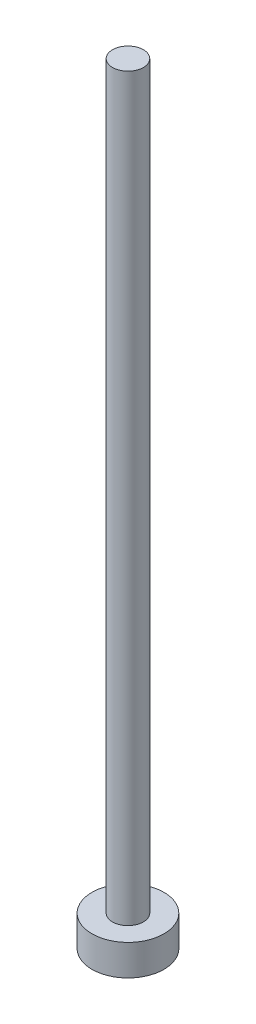
ISO-10303-21;
HEADER;
FILE_DESCRIPTION(('STEP AP214'),'2;1');
FILE_NAME('part.step','',(''),(''),'','','');
FILE_SCHEMA(('AUTOMOTIVE_DESIGN { 1 0 10303 214 1 1 1 1 }'));
ENDSEC;
DATA;
#1=APPLICATION_CONTEXT('core data for automotive mechanical design processes');
#2=APPLICATION_PROTOCOL_DEFINITION('international standard','automotive_design',2000,#1);
#3=PRODUCT_CONTEXT('',#1,'mechanical');
#4=PRODUCT('Part','Part','',(#3));
#5=PRODUCT_RELATED_PRODUCT_CATEGORY('part','',(#4));
#6=PRODUCT_DEFINITION_FORMATION('','',#4);
#7=PRODUCT_DEFINITION_CONTEXT('part definition',#1,'design');
#8=PRODUCT_DEFINITION('design','',#6,#7);
#9=PRODUCT_DEFINITION_SHAPE('','',#8);
#10=(LENGTH_UNIT() NAMED_UNIT(*) SI_UNIT(.MILLI.,.METRE.));
#11=(NAMED_UNIT(*) PLANE_ANGLE_UNIT() SI_UNIT($,.RADIAN.));
#12=(NAMED_UNIT(*) SI_UNIT($,.STERADIAN.) SOLID_ANGLE_UNIT());
#13=UNCERTAINTY_MEASURE_WITH_UNIT(LENGTH_MEASURE(1.E-05),#10,'distance_accuracy_value','');
#14=(GEOMETRIC_REPRESENTATION_CONTEXT(3) GLOBAL_UNCERTAINTY_ASSIGNED_CONTEXT((#13)) GLOBAL_UNIT_ASSIGNED_CONTEXT((#10,
#11,#12)) REPRESENTATION_CONTEXT('',''));
#15=CARTESIAN_POINT('',(0.,0.,0.));
#16=DIRECTION('',(0.,0.,1.));
#17=DIRECTION('',(1.,0.,0.));
#18=AXIS2_PLACEMENT_3D('',#15,#16,#17);
#19=CARTESIAN_POINT('',(0.869999999999995,54.6860176491151,0.));
#20=DIRECTION('',(0.,-1.,0.));
#21=DIRECTION('',(0.,0.,-1.));
#22=AXIS2_PLACEMENT_3D('',#19,#20,#21);
#23=PLANE('',#22);
#24=CARTESIAN_POINT('',(0.,54.6860176491151,0.));
#25=DIRECTION('',(0.,1.,0.));
#26=DIRECTION('',(0.,0.,1.));
#27=AXIS2_PLACEMENT_3D('',#24,#25,#26);
#28=CIRCLE('',#27,0.869999999999995);
#29=CARTESIAN_POINT('',(0.,54.6860176491151,0.869999999999995));
#30=VERTEX_POINT('',#29);
#31=EDGE_CURVE('E11',#30,#30,#28,.T.);
#32=ORIENTED_EDGE('',*,*,#31,.T.);
#33=EDGE_LOOP('',(#32));
#34=FACE_BOUND('',#33,.T.);
#35=ADVANCED_FACE('F34',(#34),#23,.F.);
#36=CARTESIAN_POINT('',(0.,58.6084508221692,0.));
#37=DIRECTION('',(0.,1.,0.));
#38=DIRECTION('',(0.,0.,1.));
#39=AXIS2_PLACEMENT_3D('',#36,#37,#38);
#40=CYLINDRICAL_SURFACE('',#39,0.87);
#41=ORIENTED_EDGE('',*,*,#31,.F.);
#42=EDGE_LOOP('',(#41));
#43=FACE_BOUND('',#42,.T.);
#44=CARTESIAN_POINT('',(0.,12.9260176491151,0.));
#45=DIRECTION('',(0.,1.,0.));
#46=DIRECTION('',(0.,0.,1.));
#47=AXIS2_PLACEMENT_3D('',#44,#45,#46);
#48=CIRCLE('',#47,0.87);
#49=CARTESIAN_POINT('',(0.,12.9260176491151,0.87));
#50=VERTEX_POINT('',#49);
#51=EDGE_CURVE('E41',#50,#50,#48,.T.);
#52=ORIENTED_EDGE('',*,*,#51,.T.);
#53=EDGE_LOOP('',(#52));
#54=FACE_BOUND('',#53,.T.);
#55=ADVANCED_FACE('F148',(#43,#54),#40,.T.);
#56=CARTESIAN_POINT('',(0.87,12.9260176491151,0.));
#57=DIRECTION('',(0.,-1.,0.));
#58=DIRECTION('',(0.,0.,-1.));
#59=AXIS2_PLACEMENT_3D('',#56,#57,#58);
#60=PLANE('',#59);
#61=ORIENTED_EDGE('',*,*,#51,.F.);
#62=EDGE_LOOP('',(#61));
#63=FACE_BOUND('',#62,.T.);
#64=CARTESIAN_POINT('',(0.,12.9260176491151,0.));
#65=DIRECTION('',(0.,1.,0.));
#66=DIRECTION('',(0.,0.,1.));
#67=AXIS2_PLACEMENT_3D('',#64,#65,#66);
#68=CIRCLE('',#67,2.03);
#69=CARTESIAN_POINT('',(0.,12.9260176491151,2.03));
#70=VERTEX_POINT('',#69);
#71=EDGE_CURVE('E143',#70,#70,#68,.T.);
#72=ORIENTED_EDGE('',*,*,#71,.T.);
#73=EDGE_LOOP('',(#72));
#74=FACE_BOUND('',#73,.T.);
#75=ADVANCED_FACE('F150',(#63,#74),#60,.F.);
#76=CARTESIAN_POINT('',(0.,58.6084508221692,0.));
#77=DIRECTION('',(0.,1.,0.));
#78=DIRECTION('',(0.,0.,1.));
#79=AXIS2_PLACEMENT_3D('',#76,#77,#78);
#80=CYLINDRICAL_SURFACE('',#79,2.03);
#81=ORIENTED_EDGE('',*,*,#71,.F.);
#82=EDGE_LOOP('',(#81));
#83=FACE_BOUND('',#82,.T.);
#84=CARTESIAN_POINT('',(0.,11.1860176491151,0.));
#85=DIRECTION('',(0.,1.,0.));
#86=DIRECTION('',(0.,0.,1.));
#87=AXIS2_PLACEMENT_3D('',#84,#85,#86);
#88=CIRCLE('',#87,2.03);
#89=CARTESIAN_POINT('',(0.,11.1860176491151,2.03));
#90=VERTEX_POINT('',#89);
#91=EDGE_CURVE('E135',#90,#90,#88,.T.);
#92=ORIENTED_EDGE('',*,*,#91,.T.);
#93=EDGE_LOOP('',(#92));
#94=FACE_BOUND('',#93,.T.);
#95=ADVANCED_FACE('F153',(#83,#94),#80,.T.);
#96=CARTESIAN_POINT('',(2.03,11.1860176491151,0.));
#97=DIRECTION('',(0.,1.,0.));
#98=DIRECTION('',(0.,0.,1.));
#99=AXIS2_PLACEMENT_3D('',#96,#97,#98);
#100=PLANE('',#99);
#101=DIRECTION('',(-0.500000000000001,0.,0.866025403784438));
#102=VECTOR('',#101,1.);
#103=CARTESIAN_POINT('',(1.45230832782873,11.1860176491151,0.));
#104=LINE('',#103,#102);
#105=CARTESIAN_POINT('',(1.45230832782873,11.1860176491151,0.));
#106=VERTEX_POINT('',#105);
#107=CARTESIAN_POINT('',(0.726154163914363,11.1860176491151,1.25773590602738));
#108=VERTEX_POINT('',#107);
#109=EDGE_CURVE('E122',#106,#108,#104,.T.);
#110=ORIENTED_EDGE('',*,*,#109,.F.);
#111=DIRECTION('',(0.499999999999995,0.,0.866025403784442));
#112=VECTOR('',#111,1.);
#113=CARTESIAN_POINT('',(0.726154163914381,11.1860176491151,-1.25773590602737));
#114=LINE('',#113,#112);
#115=CARTESIAN_POINT('',(0.726154163914381,11.1860176491151,-1.25773590602737));
#116=VERTEX_POINT('',#115);
#117=EDGE_CURVE('E48',#116,#106,#114,.T.);
#118=ORIENTED_EDGE('',*,*,#117,.F.);
#119=DIRECTION('',(1.,0.,0.));
#120=VECTOR('',#119,1.);
#121=CARTESIAN_POINT('',(-0.726154163914355,11.1860176491151,-1.25773590602739));
#122=LINE('',#121,#120);
#123=CARTESIAN_POINT('',(-0.726154163914355,11.1860176491151,-1.25773590602739));
#124=VERTEX_POINT('',#123);
#125=EDGE_CURVE('E131',#124,#116,#122,.T.);
#126=ORIENTED_EDGE('',*,*,#125,.F.);
#127=DIRECTION('',(0.500000000000007,0.,-0.866025403784435));
#128=VECTOR('',#127,1.);
#129=CARTESIAN_POINT('',(-1.45230832782873,11.1860176491151,0.));
#130=LINE('',#129,#128);
#131=CARTESIAN_POINT('',(-1.45230832782873,11.1860176491151,0.));
#132=VERTEX_POINT('',#131);
#133=EDGE_CURVE('E129',#132,#124,#130,.T.);
#134=ORIENTED_EDGE('',*,*,#133,.F.);
#135=DIRECTION('',(-0.499999999999995,0.,-0.866025403784441));
#136=VECTOR('',#135,1.);
#137=CARTESIAN_POINT('',(-0.726154163914372,11.1860176491151,1.25773590602738));
#138=LINE('',#137,#136);
#139=CARTESIAN_POINT('',(-0.726154163914372,11.1860176491151,1.25773590602738));
#140=VERTEX_POINT('',#139);
#141=EDGE_CURVE('E96',#140,#132,#138,.T.);
#142=ORIENTED_EDGE('',*,*,#141,.F.);
#143=DIRECTION('',(-1.,0.,0.));
#144=VECTOR('',#143,1.);
#145=CARTESIAN_POINT('',(0.726154163914363,11.1860176491151,1.25773590602738));
#146=LINE('',#145,#144);
#147=EDGE_CURVE('E125',#108,#140,#146,.T.);
#148=ORIENTED_EDGE('',*,*,#147,.F.);
#149=EDGE_LOOP('',(#110,#118,#126,#134,#142,#148));
#150=FACE_BOUND('',#149,.T.);
#151=ORIENTED_EDGE('',*,*,#91,.F.);
#152=EDGE_LOOP('',(#151));
#153=FACE_BOUND('',#152,.T.);
#154=ADVANCED_FACE('F159',(#150,#153),#100,.F.);
#155=CARTESIAN_POINT('',(0.726154163914381,12.3460176491151,-1.25773590602737));
#156=DIRECTION('',(0.866025403784442,0.,-0.499999999999995));
#157=DIRECTION('',(-0.499999999999995,0.,-0.866025403784442));
#158=AXIS2_PLACEMENT_3D('',#155,#156,#157);
#159=PLANE('',#158);
#160=ORIENTED_EDGE('',*,*,#117,.T.);
#161=DIRECTION('',(0.,-1.,0.));
#162=VECTOR('',#161,1.);
#163=CARTESIAN_POINT('',(1.45230832782873,12.3460176491151,0.));
#164=LINE('',#163,#162);
#165=CARTESIAN_POINT('',(1.45230832782873,12.3460176491151,0.));
#166=VERTEX_POINT('',#165);
#167=EDGE_CURVE('E78',#166,#106,#164,.T.);
#168=ORIENTED_EDGE('',*,*,#167,.F.);
#169=DIRECTION('',(0.499999999999995,0.,0.866025403784442));
#170=VECTOR('',#169,1.);
#171=CARTESIAN_POINT('',(0.726154163914381,12.3460176491151,-1.25773590602737));
#172=LINE('',#171,#170);
#173=CARTESIAN_POINT('',(0.726154163914381,12.3460176491151,-1.25773590602737));
#174=VERTEX_POINT('',#173);
#175=EDGE_CURVE('E133',#174,#166,#172,.T.);
#176=ORIENTED_EDGE('',*,*,#175,.F.);
#177=DIRECTION('',(0.,-1.,0.));
#178=VECTOR('',#177,1.);
#179=CARTESIAN_POINT('',(0.726154163914381,12.3460176491151,-1.25773590602737));
#180=LINE('',#179,#178);
#181=EDGE_CURVE('E56',#174,#116,#180,.T.);
#182=ORIENTED_EDGE('',*,*,#181,.T.);
#183=EDGE_LOOP('',(#160,#168,#176,#182));
#184=FACE_BOUND('',#183,.T.);
#185=ADVANCED_FACE('F164',(#184),#159,.F.);
#186=CARTESIAN_POINT('',(-0.726154163914355,12.3460176491151,-1.25773590602739));
#187=DIRECTION('',(0.,0.,-1.));
#188=DIRECTION('',(-1.,0.,0.));
#189=AXIS2_PLACEMENT_3D('',#186,#187,#188);
#190=PLANE('',#189);
#191=ORIENTED_EDGE('',*,*,#125,.T.);
#192=ORIENTED_EDGE('',*,*,#181,.F.);
#193=DIRECTION('',(1.,0.,0.));
#194=VECTOR('',#193,1.);
#195=CARTESIAN_POINT('',(-0.726154163914355,12.3460176491151,-1.25773590602739));
#196=LINE('',#195,#194);
#197=CARTESIAN_POINT('',(-0.726154163914355,12.3460176491151,-1.25773590602739));
#198=VERTEX_POINT('',#197);
#199=EDGE_CURVE('E108',#198,#174,#196,.T.);
#200=ORIENTED_EDGE('',*,*,#199,.F.);
#201=DIRECTION('',(0.,-1.,0.));
#202=VECTOR('',#201,1.);
#203=CARTESIAN_POINT('',(-0.726154163914355,12.3460176491151,-1.25773590602739));
#204=LINE('',#203,#202);
#205=EDGE_CURVE('E100',#198,#124,#204,.T.);
#206=ORIENTED_EDGE('',*,*,#205,.T.);
#207=EDGE_LOOP('',(#191,#192,#200,#206));
#208=FACE_BOUND('',#207,.T.);
#209=ADVANCED_FACE('F170',(#208),#190,.F.);
#210=CARTESIAN_POINT('',(-1.45230832782873,12.3460176491151,0.));
#211=DIRECTION('',(-0.866025403784435,0.,-0.500000000000007));
#212=DIRECTION('',(-0.500000000000007,0.,0.866025403784435));
#213=AXIS2_PLACEMENT_3D('',#210,#211,#212);
#214=PLANE('',#213);
#215=ORIENTED_EDGE('',*,*,#133,.T.);
#216=ORIENTED_EDGE('',*,*,#205,.F.);
#217=DIRECTION('',(0.500000000000007,0.,-0.866025403784435));
#218=VECTOR('',#217,1.);
#219=CARTESIAN_POINT('',(-1.45230832782873,12.3460176491151,0.));
#220=LINE('',#219,#218);
#221=CARTESIAN_POINT('',(-1.45230832782873,12.3460176491151,0.));
#222=VERTEX_POINT('',#221);
#223=EDGE_CURVE('E104',#222,#198,#220,.T.);
#224=ORIENTED_EDGE('',*,*,#223,.F.);
#225=DIRECTION('',(0.,-1.,0.));
#226=VECTOR('',#225,1.);
#227=CARTESIAN_POINT('',(-1.45230832782873,12.3460176491151,0.));
#228=LINE('',#227,#226);
#229=EDGE_CURVE('E89',#222,#132,#228,.T.);
#230=ORIENTED_EDGE('',*,*,#229,.T.);
#231=EDGE_LOOP('',(#215,#216,#224,#230));
#232=FACE_BOUND('',#231,.T.);
#233=ADVANCED_FACE('F105',(#232),#214,.F.);
#234=CARTESIAN_POINT('',(-0.726154163914372,12.3460176491151,1.25773590602738));
#235=DIRECTION('',(-0.866025403784441,0.,0.499999999999995));
#236=DIRECTION('',(0.499999999999995,0.,0.866025403784442));
#237=AXIS2_PLACEMENT_3D('',#234,#235,#236);
#238=PLANE('',#237);
#239=ORIENTED_EDGE('',*,*,#141,.T.);
#240=ORIENTED_EDGE('',*,*,#229,.F.);
#241=DIRECTION('',(-0.499999999999995,0.,-0.866025403784441));
#242=VECTOR('',#241,1.);
#243=CARTESIAN_POINT('',(-0.726154163914372,12.3460176491151,1.25773590602738));
#244=LINE('',#243,#242);
#245=CARTESIAN_POINT('',(-0.726154163914372,12.3460176491151,1.25773590602738));
#246=VERTEX_POINT('',#245);
#247=EDGE_CURVE('E93',#246,#222,#244,.T.);
#248=ORIENTED_EDGE('',*,*,#247,.F.);
#249=DIRECTION('',(0.,-1.,0.));
#250=VECTOR('',#249,1.);
#251=CARTESIAN_POINT('',(-0.726154163914372,12.3460176491151,1.25773590602738));
#252=LINE('',#251,#250);
#253=EDGE_CURVE('E101',#246,#140,#252,.T.);
#254=ORIENTED_EDGE('',*,*,#253,.T.);
#255=EDGE_LOOP('',(#239,#240,#248,#254));
#256=FACE_BOUND('',#255,.T.);
#257=ADVANCED_FACE('F91',(#256),#238,.F.);
#258=CARTESIAN_POINT('',(0.726154163914363,12.3460176491151,1.25773590602738));
#259=DIRECTION('',(0.,0.,1.));
#260=DIRECTION('',(1.,0.,0.));
#261=AXIS2_PLACEMENT_3D('',#258,#259,#260);
#262=PLANE('',#261);
#263=ORIENTED_EDGE('',*,*,#147,.T.);
#264=ORIENTED_EDGE('',*,*,#253,.F.);
#265=DIRECTION('',(-1.,0.,0.));
#266=VECTOR('',#265,1.);
#267=CARTESIAN_POINT('',(0.726154163914363,12.3460176491151,1.25773590602738));
#268=LINE('',#267,#266);
#269=CARTESIAN_POINT('',(0.726154163914363,12.3460176491151,1.25773590602738));
#270=VERTEX_POINT('',#269);
#271=EDGE_CURVE('E114',#270,#246,#268,.T.);
#272=ORIENTED_EDGE('',*,*,#271,.F.);
#273=DIRECTION('',(0.,-1.,0.));
#274=VECTOR('',#273,1.);
#275=CARTESIAN_POINT('',(0.726154163914363,12.3460176491151,1.25773590602738));
#276=LINE('',#275,#274);
#277=EDGE_CURVE('E138',#270,#108,#276,.T.);
#278=ORIENTED_EDGE('',*,*,#277,.T.);
#279=EDGE_LOOP('',(#263,#264,#272,#278));
#280=FACE_BOUND('',#279,.T.);
#281=ADVANCED_FACE('F225',(#280),#262,.F.);
#282=CARTESIAN_POINT('',(1.45230832782873,12.3460176491151,0.));
#283=DIRECTION('',(0.866025403784438,0.,0.500000000000001));
#284=DIRECTION('',(0.500000000000001,0.,-0.866025403784438));
#285=AXIS2_PLACEMENT_3D('',#282,#283,#284);
#286=PLANE('',#285);
#287=ORIENTED_EDGE('',*,*,#109,.T.);
#288=ORIENTED_EDGE('',*,*,#277,.F.);
#289=DIRECTION('',(-0.500000000000001,0.,0.866025403784438));
#290=VECTOR('',#289,1.);
#291=CARTESIAN_POINT('',(1.45230832782873,12.3460176491151,0.));
#292=LINE('',#291,#290);
#293=EDGE_CURVE('E116',#166,#270,#292,.T.);
#294=ORIENTED_EDGE('',*,*,#293,.F.);
#295=ORIENTED_EDGE('',*,*,#167,.T.);
#296=EDGE_LOOP('',(#287,#288,#294,#295));
#297=FACE_BOUND('',#296,.T.);
#298=ADVANCED_FACE('F234',(#297),#286,.F.);
#299=CARTESIAN_POINT('',(0.,12.3460176491151,0.));
#300=DIRECTION('',(0.,-1.,0.));
#301=DIRECTION('',(0.,0.,-1.));
#302=AXIS2_PLACEMENT_3D('',#299,#300,#301);
#303=PLANE('',#302);
#304=ORIENTED_EDGE('',*,*,#175,.T.);
#305=ORIENTED_EDGE('',*,*,#293,.T.);
#306=ORIENTED_EDGE('',*,*,#271,.T.);
#307=ORIENTED_EDGE('',*,*,#247,.T.);
#308=ORIENTED_EDGE('',*,*,#223,.T.);
#309=ORIENTED_EDGE('',*,*,#199,.T.);
#310=EDGE_LOOP('',(#304,#305,#306,#307,#308,#309));
#311=FACE_BOUND('',#310,.T.);
#312=ADVANCED_FACE('F111',(#311),#303,.T.);
#313=CLOSED_SHELL('',(#35,#55,#75,#95,#154,#185,#209,#233,#257,#281,#298,#312));
#314=MANIFOLD_SOLID_BREP('B2',#313);
#315=ADVANCED_BREP_SHAPE_REPRESENTATION('',(#18,#314),#14);
#316=SHAPE_DEFINITION_REPRESENTATION(#9,#315);
ENDSEC;
END-ISO-10303-21;
